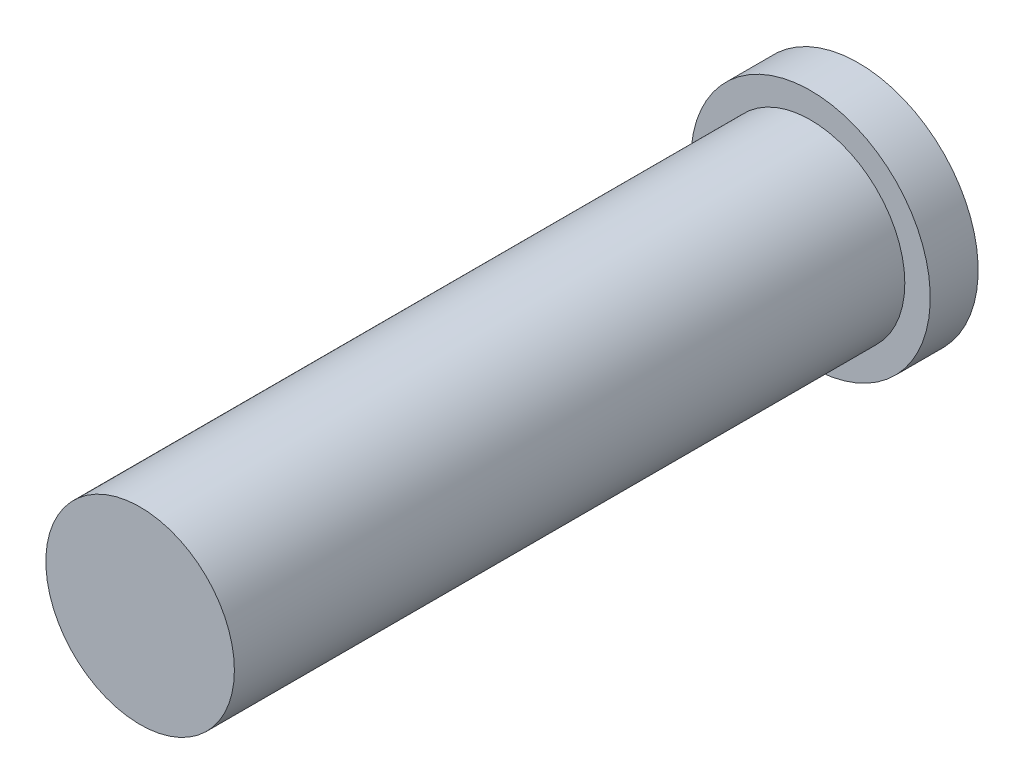
ISO-10303-21;
HEADER;
FILE_DESCRIPTION(('STEP AP214'),'2;1');
FILE_NAME('part.step','',(''),(''),'','','');
FILE_SCHEMA(('AUTOMOTIVE_DESIGN { 1 0 10303 214 1 1 1 1 }'));
ENDSEC;
DATA;
#1=APPLICATION_CONTEXT('core data for automotive mechanical design processes');
#2=APPLICATION_PROTOCOL_DEFINITION('international standard','automotive_design',2000,#1);
#3=PRODUCT_CONTEXT('',#1,'mechanical');
#4=PRODUCT('Part','Part','',(#3));
#5=PRODUCT_RELATED_PRODUCT_CATEGORY('part','',(#4));
#6=PRODUCT_DEFINITION_FORMATION('','',#4);
#7=PRODUCT_DEFINITION_CONTEXT('part definition',#1,'design');
#8=PRODUCT_DEFINITION('design','',#6,#7);
#9=PRODUCT_DEFINITION_SHAPE('','',#8);
#10=(LENGTH_UNIT() NAMED_UNIT(*) SI_UNIT(.MILLI.,.METRE.));
#11=(NAMED_UNIT(*) PLANE_ANGLE_UNIT() SI_UNIT($,.RADIAN.));
#12=(NAMED_UNIT(*) SI_UNIT($,.STERADIAN.) SOLID_ANGLE_UNIT());
#13=UNCERTAINTY_MEASURE_WITH_UNIT(LENGTH_MEASURE(1.E-05),#10,'distance_accuracy_value','');
#14=(GEOMETRIC_REPRESENTATION_CONTEXT(3) GLOBAL_UNCERTAINTY_ASSIGNED_CONTEXT((#13)) GLOBAL_UNIT_ASSIGNED_CONTEXT((#10,
#11,#12)) REPRESENTATION_CONTEXT('',''));
#15=CARTESIAN_POINT('',(0.,0.,0.));
#16=DIRECTION('',(0.,0.,1.));
#17=DIRECTION('',(1.,0.,0.));
#18=AXIS2_PLACEMENT_3D('',#15,#16,#17);
#19=CARTESIAN_POINT('',(13.0745766688371,1.62303821074728,25.4));
#20=DIRECTION('',(0.,0.,-1.));
#21=DIRECTION('',(-1.,0.,0.));
#22=AXIS2_PLACEMENT_3D('',#19,#20,#21);
#23=CYLINDRICAL_SURFACE('',#22,2.5);
#24=CARTESIAN_POINT('',(13.0745766688371,1.62303821074728,-2.54));
#25=DIRECTION('',(0.,0.,-1.));
#26=DIRECTION('',(-1.,0.,0.));
#27=AXIS2_PLACEMENT_3D('',#24,#25,#26);
#28=CIRCLE('',#27,2.5);
#29=CARTESIAN_POINT('',(10.5745766688371,1.62303821074728,-2.54));
#30=VERTEX_POINT('',#29);
#31=EDGE_CURVE('E46',#30,#30,#28,.T.);
#32=ORIENTED_EDGE('',*,*,#31,.T.);
#33=EDGE_LOOP('',(#32));
#34=FACE_BOUND('',#33,.T.);
#35=CARTESIAN_POINT('',(13.0745766688371,1.62303821074728,26.035));
#36=DIRECTION('',(0.,0.,-1.));
#37=DIRECTION('',(-1.,0.,0.));
#38=AXIS2_PLACEMENT_3D('',#35,#36,#37);
#39=CIRCLE('',#38,2.5);
#40=CARTESIAN_POINT('',(10.5745766688371,1.62303821074728,26.035));
#41=VERTEX_POINT('',#40);
#42=EDGE_CURVE('E51',#41,#41,#39,.T.);
#43=ORIENTED_EDGE('',*,*,#42,.F.);
#44=EDGE_LOOP('',(#43));
#45=FACE_BOUND('',#44,.T.);
#46=ADVANCED_FACE('F30',(#34,#45),#23,.F.);
#47=CARTESIAN_POINT('',(13.0745766688371,1.62303821074728,35.56));
#48=DIRECTION('',(0.,0.,-1.));
#49=DIRECTION('',(-1.,0.,0.));
#50=AXIS2_PLACEMENT_3D('',#47,#48,#49);
#51=CYLINDRICAL_SURFACE('',#50,5.);
#52=CARTESIAN_POINT('',(13.0745766688371,1.62303821074728,35.56));
#53=DIRECTION('',(0.,0.,1.));
#54=DIRECTION('',(1.,0.,0.));
#55=AXIS2_PLACEMENT_3D('',#52,#53,#54);
#56=CIRCLE('',#55,5.);
#57=CARTESIAN_POINT('',(18.0745766688371,1.62303821074728,35.56));
#58=VERTEX_POINT('',#57);
#59=EDGE_CURVE('E10',#58,#58,#56,.T.);
#60=ORIENTED_EDGE('',*,*,#59,.F.);
#61=EDGE_LOOP('',(#60));
#62=FACE_BOUND('',#61,.T.);
#63=CARTESIAN_POINT('',(13.0745766688371,1.62303821074728,0.));
#64=DIRECTION('',(0.,0.,1.));
#65=DIRECTION('',(1.,0.,0.));
#66=AXIS2_PLACEMENT_3D('',#63,#64,#65);
#67=CIRCLE('',#66,5.);
#68=CARTESIAN_POINT('',(18.0745766688371,1.62303821074728,0.));
#69=VERTEX_POINT('',#68);
#70=EDGE_CURVE('E34',#69,#69,#67,.T.);
#71=ORIENTED_EDGE('',*,*,#70,.T.);
#72=EDGE_LOOP('',(#71));
#73=FACE_BOUND('',#72,.T.);
#74=ADVANCED_FACE('F32',(#62,#73),#51,.T.);
#75=CARTESIAN_POINT('',(13.0745766688371,1.62303821074728,35.56));
#76=DIRECTION('',(0.,0.,1.));
#77=DIRECTION('',(1.,0.,0.));
#78=AXIS2_PLACEMENT_3D('',#75,#76,#77);
#79=PLANE('',#78);
#80=ORIENTED_EDGE('',*,*,#59,.T.);
#81=EDGE_LOOP('',(#80));
#82=FACE_BOUND('',#81,.T.);
#83=ADVANCED_FACE('F63',(#82),#79,.T.);
#84=CARTESIAN_POINT('',(13.0745766688371,1.62303821074728,0.));
#85=DIRECTION('',(0.,0.,-1.));
#86=DIRECTION('',(-1.,0.,0.));
#87=AXIS2_PLACEMENT_3D('',#84,#85,#86);
#88=PLANE('',#87);
#89=ORIENTED_EDGE('',*,*,#70,.F.);
#90=EDGE_LOOP('',(#89));
#91=FACE_BOUND('',#90,.T.);
#92=CARTESIAN_POINT('',(13.0745766688371,1.62303821074728,0.));
#93=DIRECTION('',(0.,0.,-1.));
#94=DIRECTION('',(-1.,0.,0.));
#95=AXIS2_PLACEMENT_3D('',#92,#93,#94);
#96=CIRCLE('',#95,6.35);
#97=CARTESIAN_POINT('',(6.72457666883707,1.62303821074728,0.));
#98=VERTEX_POINT('',#97);
#99=EDGE_CURVE('E43',#98,#98,#96,.T.);
#100=ORIENTED_EDGE('',*,*,#99,.F.);
#101=EDGE_LOOP('',(#100));
#102=FACE_BOUND('',#101,.T.);
#103=ADVANCED_FACE('F69',(#91,#102),#88,.F.);
#104=CARTESIAN_POINT('',(13.0745766688371,1.62303821074728,-2.54));
#105=DIRECTION('',(0.,0.,1.));
#106=DIRECTION('',(1.,0.,0.));
#107=AXIS2_PLACEMENT_3D('',#104,#105,#106);
#108=CYLINDRICAL_SURFACE('',#107,6.35);
#109=CARTESIAN_POINT('',(13.0745766688371,1.62303821074728,-2.54));
#110=DIRECTION('',(0.,0.,-1.));
#111=DIRECTION('',(-1.,0.,0.));
#112=AXIS2_PLACEMENT_3D('',#109,#110,#111);
#113=CIRCLE('',#112,6.35);
#114=CARTESIAN_POINT('',(6.72457666883707,1.62303821074728,-2.54));
#115=VERTEX_POINT('',#114);
#116=EDGE_CURVE('E41',#115,#115,#113,.T.);
#117=ORIENTED_EDGE('',*,*,#116,.F.);
#118=EDGE_LOOP('',(#117));
#119=FACE_BOUND('',#118,.T.);
#120=ORIENTED_EDGE('',*,*,#99,.T.);
#121=EDGE_LOOP('',(#120));
#122=FACE_BOUND('',#121,.T.);
#123=ADVANCED_FACE('F66',(#119,#122),#108,.T.);
#124=CARTESIAN_POINT('',(13.0745766688371,1.62303821074728,-2.54));
#125=DIRECTION('',(0.,0.,-1.));
#126=DIRECTION('',(-1.,0.,0.));
#127=AXIS2_PLACEMENT_3D('',#124,#125,#126);
#128=PLANE('',#127);
#129=ORIENTED_EDGE('',*,*,#31,.F.);
#130=EDGE_LOOP('',(#129));
#131=FACE_BOUND('',#130,.T.);
#132=ORIENTED_EDGE('',*,*,#116,.T.);
#133=EDGE_LOOP('',(#132));
#134=FACE_BOUND('',#133,.T.);
#135=ADVANCED_FACE('F77',(#131,#134),#128,.T.);
#136=CARTESIAN_POINT('',(13.0745766688371,1.62303821074728,26.035));
#137=DIRECTION('',(0.,0.,-1.));
#138=DIRECTION('',(-1.,0.,0.));
#139=AXIS2_PLACEMENT_3D('',#136,#137,#138);
#140=PLANE('',#139);
#141=ORIENTED_EDGE('',*,*,#42,.T.);
#142=EDGE_LOOP('',(#141));
#143=FACE_BOUND('',#142,.T.);
#144=ADVANCED_FACE('F55',(#143),#140,.T.);
#145=CLOSED_SHELL('',(#46,#74,#83,#103,#123,#135,#144));
#146=MANIFOLD_SOLID_BREP('B2',#145);
#147=ADVANCED_BREP_SHAPE_REPRESENTATION('',(#18,#146),#14);
#148=SHAPE_DEFINITION_REPRESENTATION(#9,#147);
ENDSEC;
END-ISO-10303-21;
